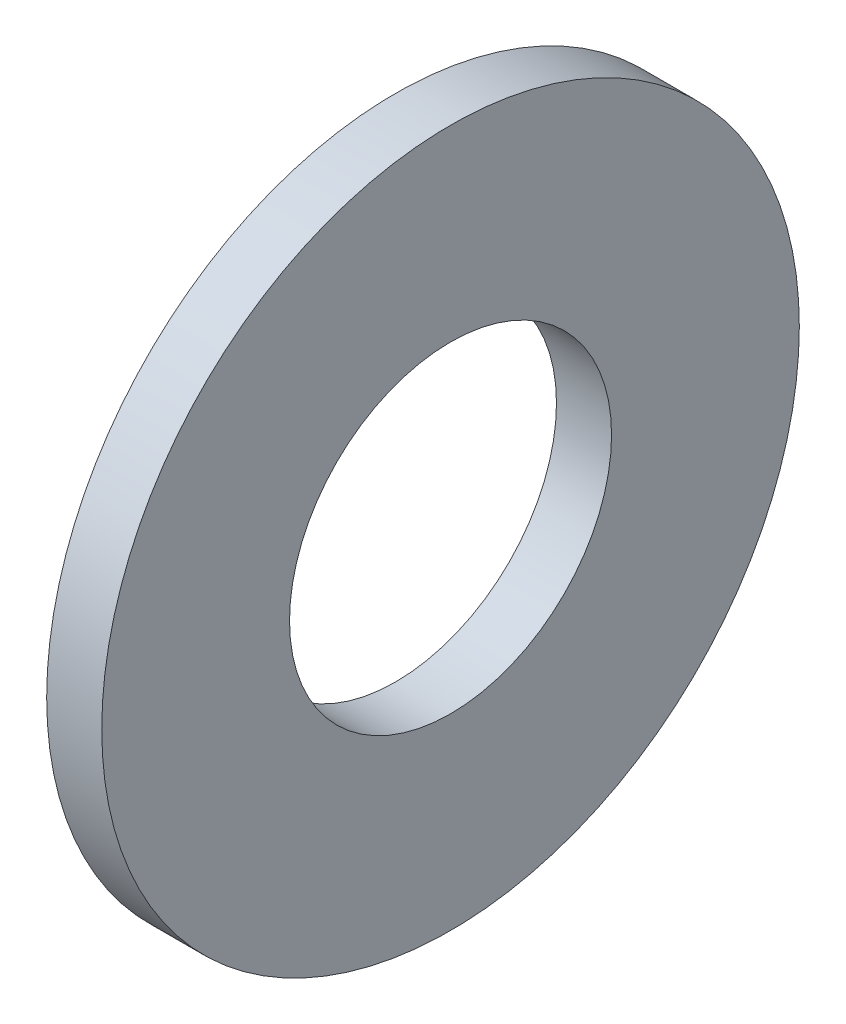
ISO-10303-21;
HEADER;
FILE_DESCRIPTION(('STEP AP214'),'2;1');
FILE_NAME('part.step','',(''),(''),'','','');
FILE_SCHEMA(('AUTOMOTIVE_DESIGN { 1 0 10303 214 1 1 1 1 }'));
ENDSEC;
DATA;
#1=APPLICATION_CONTEXT('core data for automotive mechanical design processes');
#2=APPLICATION_PROTOCOL_DEFINITION('international standard','automotive_design',2000,#1);
#3=PRODUCT_CONTEXT('',#1,'mechanical');
#4=PRODUCT('Part','Part','',(#3));
#5=PRODUCT_RELATED_PRODUCT_CATEGORY('part','',(#4));
#6=PRODUCT_DEFINITION_FORMATION('','',#4);
#7=PRODUCT_DEFINITION_CONTEXT('part definition',#1,'design');
#8=PRODUCT_DEFINITION('design','',#6,#7);
#9=PRODUCT_DEFINITION_SHAPE('','',#8);
#10=(LENGTH_UNIT() NAMED_UNIT(*) SI_UNIT(.MILLI.,.METRE.));
#11=(NAMED_UNIT(*) PLANE_ANGLE_UNIT() SI_UNIT($,.RADIAN.));
#12=(NAMED_UNIT(*) SI_UNIT($,.STERADIAN.) SOLID_ANGLE_UNIT());
#13=UNCERTAINTY_MEASURE_WITH_UNIT(LENGTH_MEASURE(1.E-05),#10,'distance_accuracy_value','');
#14=(GEOMETRIC_REPRESENTATION_CONTEXT(3) GLOBAL_UNCERTAINTY_ASSIGNED_CONTEXT((#13)) GLOBAL_UNIT_ASSIGNED_CONTEXT((#10,
#11,#12)) REPRESENTATION_CONTEXT('',''));
#15=CARTESIAN_POINT('',(0.,0.,0.));
#16=DIRECTION('',(0.,0.,1.));
#17=DIRECTION('',(1.,0.,0.));
#18=AXIS2_PLACEMENT_3D('',#15,#16,#17);
#19=CARTESIAN_POINT('',(16.4089068717294,6.67730279951274,0.));
#20=DIRECTION('',(1.,0.,0.));
#21=DIRECTION('',(0.,0.,-1.));
#22=AXIS2_PLACEMENT_3D('',#19,#20,#21);
#23=PLANE('',#22);
#24=CARTESIAN_POINT('',(16.4089068717294,-2.09382712154138,0.));
#25=DIRECTION('',(-1.,0.,0.));
#26=DIRECTION('',(0.,0.,1.));
#27=AXIS2_PLACEMENT_3D('',#24,#25,#26);
#28=CIRCLE('',#27,8.77112992105412);
#29=CARTESIAN_POINT('',(16.4089068717294,-2.09382712154138,8.77112992105412));
#30=VERTEX_POINT('',#29);
#31=EDGE_CURVE('E58',#30,#30,#28,.T.);
#32=ORIENTED_EDGE('',*,*,#31,.F.);
#33=EDGE_LOOP('',(#32));
#34=FACE_BOUND('',#33,.T.);
#35=CARTESIAN_POINT('',(16.4089068717294,-2.09382712154138,0.));
#36=DIRECTION('',(-1.,0.,0.));
#37=DIRECTION('',(0.,0.,1.));
#38=AXIS2_PLACEMENT_3D('',#35,#36,#37);
#39=CIRCLE('',#38,19.);
#40=CARTESIAN_POINT('',(16.4089068717294,-2.09382712154138,19.));
#41=VERTEX_POINT('',#40);
#42=EDGE_CURVE('E10',#41,#41,#39,.T.);
#43=ORIENTED_EDGE('',*,*,#42,.T.);
#44=EDGE_LOOP('',(#43));
#45=FACE_BOUND('',#44,.T.);
#46=ADVANCED_FACE('F41',(#34,#45),#23,.F.);
#47=CARTESIAN_POINT('',(-16.7626873949071,-2.09382712154138,0.));
#48=DIRECTION('',(-1.,0.,0.));
#49=DIRECTION('',(0.,0.,1.));
#50=AXIS2_PLACEMENT_3D('',#47,#48,#49);
#51=CYLINDRICAL_SURFACE('',#50,19.);
#52=ORIENTED_EDGE('',*,*,#42,.F.);
#53=EDGE_LOOP('',(#52));
#54=FACE_BOUND('',#53,.T.);
#55=CARTESIAN_POINT('',(19.4089068717294,-2.09382712154138,0.));
#56=DIRECTION('',(-1.,0.,0.));
#57=DIRECTION('',(0.,0.,1.));
#58=AXIS2_PLACEMENT_3D('',#55,#56,#57);
#59=CIRCLE('',#58,19.);
#60=CARTESIAN_POINT('',(19.4089068717294,-2.09382712154138,19.));
#61=VERTEX_POINT('',#60);
#62=EDGE_CURVE('E48',#61,#61,#59,.T.);
#63=ORIENTED_EDGE('',*,*,#62,.T.);
#64=EDGE_LOOP('',(#63));
#65=FACE_BOUND('',#64,.T.);
#66=ADVANCED_FACE('F68',(#54,#65),#51,.T.);
#67=CARTESIAN_POINT('',(19.4089068717294,6.67730279951274,0.));
#68=DIRECTION('',(-1.,0.,0.));
#69=DIRECTION('',(0.,0.,1.));
#70=AXIS2_PLACEMENT_3D('',#67,#68,#69);
#71=PLANE('',#70);
#72=ORIENTED_EDGE('',*,*,#62,.F.);
#73=EDGE_LOOP('',(#72));
#74=FACE_BOUND('',#73,.T.);
#75=CARTESIAN_POINT('',(19.4089068717294,-2.09382712154138,0.));
#76=DIRECTION('',(-1.,0.,0.));
#77=DIRECTION('',(0.,0.,1.));
#78=AXIS2_PLACEMENT_3D('',#75,#76,#77);
#79=CIRCLE('',#78,8.77112992105412);
#80=CARTESIAN_POINT('',(19.4089068717294,-2.09382712154138,8.77112992105412));
#81=VERTEX_POINT('',#80);
#82=EDGE_CURVE('E53',#81,#81,#79,.T.);
#83=ORIENTED_EDGE('',*,*,#82,.T.);
#84=EDGE_LOOP('',(#83));
#85=FACE_BOUND('',#84,.T.);
#86=ADVANCED_FACE('F72',(#74,#85),#71,.F.);
#87=CARTESIAN_POINT('',(-16.7626873949071,-2.09382712154138,0.));
#88=DIRECTION('',(-1.,0.,0.));
#89=DIRECTION('',(0.,0.,1.));
#90=AXIS2_PLACEMENT_3D('',#87,#88,#89);
#91=CYLINDRICAL_SURFACE('',#90,8.77112992105412);
#92=ORIENTED_EDGE('',*,*,#82,.F.);
#93=EDGE_LOOP('',(#92));
#94=FACE_BOUND('',#93,.T.);
#95=ORIENTED_EDGE('',*,*,#31,.T.);
#96=EDGE_LOOP('',(#95));
#97=FACE_BOUND('',#96,.T.);
#98=ADVANCED_FACE('F65',(#94,#97),#91,.F.);
#99=CLOSED_SHELL('',(#46,#66,#86,#98));
#100=MANIFOLD_SOLID_BREP('B2',#99);
#101=ADVANCED_BREP_SHAPE_REPRESENTATION('',(#18,#100),#14);
#102=SHAPE_DEFINITION_REPRESENTATION(#9,#101);
ENDSEC;
END-ISO-10303-21;
